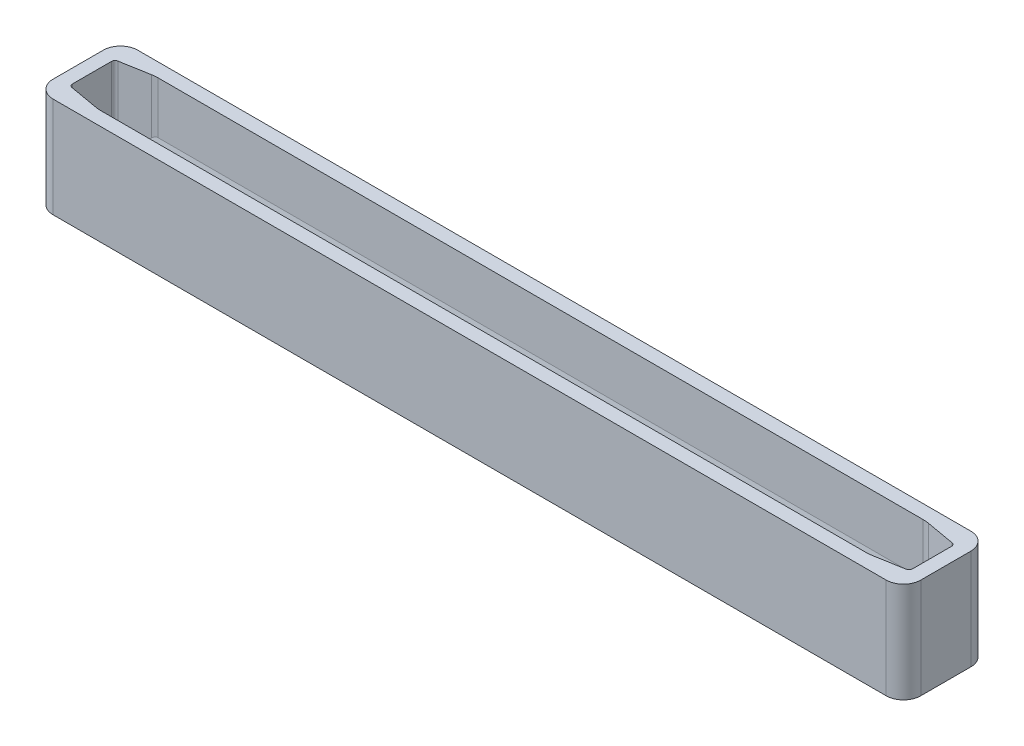
ISO-10303-21;
HEADER;
FILE_DESCRIPTION(('STEP AP214'),'2;1');
FILE_NAME('part.step','',(''),(''),'','','');
FILE_SCHEMA(('AUTOMOTIVE_DESIGN { 1 0 10303 214 1 1 1 1 }'));
ENDSEC;
DATA;
#1=APPLICATION_CONTEXT('core data for automotive mechanical design processes');
#2=APPLICATION_PROTOCOL_DEFINITION('international standard','automotive_design',2000,#1);
#3=PRODUCT_CONTEXT('',#1,'mechanical');
#4=PRODUCT('Part','Part','',(#3));
#5=PRODUCT_RELATED_PRODUCT_CATEGORY('part','',(#4));
#6=PRODUCT_DEFINITION_FORMATION('','',#4);
#7=PRODUCT_DEFINITION_CONTEXT('part definition',#1,'design');
#8=PRODUCT_DEFINITION('design','',#6,#7);
#9=PRODUCT_DEFINITION_SHAPE('','',#8);
#10=(LENGTH_UNIT() NAMED_UNIT(*) SI_UNIT(.MILLI.,.METRE.));
#11=(NAMED_UNIT(*) PLANE_ANGLE_UNIT() SI_UNIT($,.RADIAN.));
#12=(NAMED_UNIT(*) SI_UNIT($,.STERADIAN.) SOLID_ANGLE_UNIT());
#13=UNCERTAINTY_MEASURE_WITH_UNIT(LENGTH_MEASURE(1.E-05),#10,'distance_accuracy_value','');
#14=(GEOMETRIC_REPRESENTATION_CONTEXT(3) GLOBAL_UNCERTAINTY_ASSIGNED_CONTEXT((#13)) GLOBAL_UNIT_ASSIGNED_CONTEXT((#10,
#11,#12)) REPRESENTATION_CONTEXT('',''));
#15=CARTESIAN_POINT('',(0.,0.,0.));
#16=DIRECTION('',(0.,0.,1.));
#17=DIRECTION('',(1.,0.,0.));
#18=AXIS2_PLACEMENT_3D('',#15,#16,#17);
#19=CARTESIAN_POINT('',(0.,25.,0.));
#20=DIRECTION('',(0.,-1.,0.));
#21=DIRECTION('',(0.,0.,-1.));
#22=AXIS2_PLACEMENT_3D('',#19,#20,#21);
#23=PLANE('',#22);
#24=DIRECTION('',(0.,0.,-1.));
#25=VECTOR('',#24,1.);
#26=CARTESIAN_POINT('',(125.5,25.,12.25));
#27=LINE('',#26,#25);
#28=CARTESIAN_POINT('',(125.5,25.,7.25000000000001));
#29=VERTEX_POINT('',#28);
#30=CARTESIAN_POINT('',(125.5,25.,-7.24999999999999));
#31=VERTEX_POINT('',#30);
#32=EDGE_CURVE('E262',#29,#31,#27,.T.);
#33=ORIENTED_EDGE('',*,*,#32,.T.);
#34=CARTESIAN_POINT('',(120.5,25.,-7.24999999999999));
#35=DIRECTION('',(0.,-1.,0.));
#36=DIRECTION('',(0.,0.,-1.));
#37=AXIS2_PLACEMENT_3D('',#34,#35,#36);
#38=CIRCLE('',#37,5.);
#39=CARTESIAN_POINT('',(120.5,25.,-12.25));
#40=VERTEX_POINT('',#39);
#41=EDGE_CURVE('E600',#31,#40,#38,.F.);
#42=ORIENTED_EDGE('',*,*,#41,.T.);
#43=DIRECTION('',(-1.,0.,0.));
#44=VECTOR('',#43,1.);
#45=CARTESIAN_POINT('',(-125.5,25.,-12.25));
#46=LINE('',#45,#44);
#47=CARTESIAN_POINT('',(-120.5,25.,-12.25));
#48=VERTEX_POINT('',#47);
#49=EDGE_CURVE('E265',#40,#48,#46,.T.);
#50=ORIENTED_EDGE('',*,*,#49,.T.);
#51=CARTESIAN_POINT('',(-120.5,25.,-7.24999999999999));
#52=DIRECTION('',(0.,-1.,0.));
#53=DIRECTION('',(0.,0.,-1.));
#54=AXIS2_PLACEMENT_3D('',#51,#52,#53);
#55=CIRCLE('',#54,5.);
#56=CARTESIAN_POINT('',(-125.5,25.,-7.24999999999999));
#57=VERTEX_POINT('',#56);
#58=EDGE_CURVE('E596',#48,#57,#55,.F.);
#59=ORIENTED_EDGE('',*,*,#58,.T.);
#60=DIRECTION('',(0.,0.,1.));
#61=VECTOR('',#60,1.);
#62=CARTESIAN_POINT('',(-125.5,25.,12.25));
#63=LINE('',#62,#61);
#64=CARTESIAN_POINT('',(-125.5,25.,7.25000000000001));
#65=VERTEX_POINT('',#64);
#66=EDGE_CURVE('E251',#57,#65,#63,.T.);
#67=ORIENTED_EDGE('',*,*,#66,.T.);
#68=CARTESIAN_POINT('',(-120.5,25.,7.25000000000001));
#69=DIRECTION('',(0.,-1.,0.));
#70=DIRECTION('',(0.,0.,-1.));
#71=AXIS2_PLACEMENT_3D('',#68,#69,#70);
#72=CIRCLE('',#71,5.);
#73=CARTESIAN_POINT('',(-120.5,25.,12.25));
#74=VERTEX_POINT('',#73);
#75=EDGE_CURVE('E57',#65,#74,#72,.F.);
#76=ORIENTED_EDGE('',*,*,#75,.T.);
#77=DIRECTION('',(1.,0.,0.));
#78=VECTOR('',#77,1.);
#79=CARTESIAN_POINT('',(-125.5,25.,12.25));
#80=LINE('',#79,#78);
#81=CARTESIAN_POINT('',(120.5,25.,12.25));
#82=VERTEX_POINT('',#81);
#83=EDGE_CURVE('E254',#74,#82,#80,.T.);
#84=ORIENTED_EDGE('',*,*,#83,.T.);
#85=CARTESIAN_POINT('',(120.5,25.,7.25000000000001));
#86=DIRECTION('',(0.,-1.,0.));
#87=DIRECTION('',(0.,0.,-1.));
#88=AXIS2_PLACEMENT_3D('',#85,#86,#87);
#89=CIRCLE('',#88,5.);
#90=EDGE_CURVE('E598',#82,#29,#89,.F.);
#91=ORIENTED_EDGE('',*,*,#90,.T.);
#92=EDGE_LOOP('',(#33,#42,#50,#59,#67,#76,#84,#91));
#93=FACE_BOUND('',#92,.T.);
#94=DIRECTION('',(0.,0.,-1.));
#95=VECTOR('',#94,1.);
#96=CARTESIAN_POINT('',(121.5,25.,8.25000000000001));
#97=LINE('',#96,#95);
#98=CARTESIAN_POINT('',(121.5,25.,5.64763056173808));
#99=VERTEX_POINT('',#98);
#100=CARTESIAN_POINT('',(121.5,25.,-5.64763056173805));
#101=VERTEX_POINT('',#100);
#102=EDGE_CURVE('E529',#99,#101,#97,.T.);
#103=ORIENTED_EDGE('',*,*,#102,.F.);
#104=CARTESIAN_POINT('',(120.5,25.,5.64763056173808));
#105=DIRECTION('',(0.,-1.,0.));
#106=DIRECTION('',(0.,0.,-1.));
#107=AXIS2_PLACEMENT_3D('',#104,#105,#106);
#108=CIRCLE('',#107,1.);
#109=CARTESIAN_POINT('',(120.673648177667,25.,6.63243831475027));
#110=VERTEX_POINT('',#109);
#111=EDGE_CURVE('E345',#99,#110,#108,.T.);
#112=ORIENTED_EDGE('',*,*,#111,.T.);
#113=DIRECTION('',(0.984807753012207,0.,-0.173648177666935));
#114=VECTOR('',#113,1.);
#115=CARTESIAN_POINT('',(4.77296948240425,25.,27.0688550511485));
#116=LINE('',#115,#114);
#117=CARTESIAN_POINT('',(112.361595141411,25.,8.09807753012207));
#118=VERTEX_POINT('',#117);
#119=EDGE_CURVE('E278',#110,#118,#116,.F.);
#120=ORIENTED_EDGE('',*,*,#119,.T.);
#121=CARTESIAN_POINT('',(110.625113364741,25.,-1.74999999999999));
#122=DIRECTION('',(0.,-1.,0.));
#123=DIRECTION('',(0.,0.,-1.));
#124=AXIS2_PLACEMENT_3D('',#121,#122,#123);
#125=CIRCLE('',#124,10.);
#126=CARTESIAN_POINT('',(110.625113364741,25.,8.25000000000001));
#127=VERTEX_POINT('',#126);
#128=EDGE_CURVE('E250',#118,#127,#125,.T.);
#129=ORIENTED_EDGE('',*,*,#128,.T.);
#130=DIRECTION('',(1.,0.,0.));
#131=VECTOR('',#130,1.);
#132=CARTESIAN_POINT('',(-121.5,25.,8.25000000000001));
#133=LINE('',#132,#131);
#134=CARTESIAN_POINT('',(-110.625113364741,25.,8.25000000000001));
#135=VERTEX_POINT('',#134);
#136=EDGE_CURVE('E241',#135,#127,#133,.T.);
#137=ORIENTED_EDGE('',*,*,#136,.F.);
#138=CARTESIAN_POINT('',(-110.625113364741,25.,-1.74999999999999));
#139=DIRECTION('',(0.,-1.,0.));
#140=DIRECTION('',(0.,0.,-1.));
#141=AXIS2_PLACEMENT_3D('',#138,#139,#140);
#142=CIRCLE('',#141,10.);
#143=CARTESIAN_POINT('',(-112.36159514141,25.,8.09807753012208));
#144=VERTEX_POINT('',#143);
#145=EDGE_CURVE('E222',#135,#144,#142,.T.);
#146=ORIENTED_EDGE('',*,*,#145,.T.);
#147=DIRECTION('',(0.984807753012207,0.,0.173648177666935));
#148=VECTOR('',#147,1.);
#149=CARTESIAN_POINT('',(-4.77296948240423,25.,27.0688550511484));
#150=LINE('',#149,#148);
#151=CARTESIAN_POINT('',(-120.673648177667,25.,6.63243831475028));
#152=VERTEX_POINT('',#151);
#153=EDGE_CURVE('E280',#144,#152,#150,.F.);
#154=ORIENTED_EDGE('',*,*,#153,.T.);
#155=CARTESIAN_POINT('',(-120.5,25.,5.64763056173808));
#156=DIRECTION('',(0.,-1.,0.));
#157=DIRECTION('',(0.,0.,-1.));
#158=AXIS2_PLACEMENT_3D('',#155,#156,#157);
#159=CIRCLE('',#158,1.);
#160=CARTESIAN_POINT('',(-121.5,25.,5.64763056173808));
#161=VERTEX_POINT('',#160);
#162=EDGE_CURVE('E349',#152,#161,#159,.T.);
#163=ORIENTED_EDGE('',*,*,#162,.T.);
#164=DIRECTION('',(0.,0.,1.));
#165=VECTOR('',#164,1.);
#166=CARTESIAN_POINT('',(-121.5,25.,8.25000000000001));
#167=LINE('',#166,#165);
#168=CARTESIAN_POINT('',(-121.5,25.,-5.64763056173805));
#169=VERTEX_POINT('',#168);
#170=EDGE_CURVE('E252',#169,#161,#167,.T.);
#171=ORIENTED_EDGE('',*,*,#170,.F.);
#172=CARTESIAN_POINT('',(-120.5,25.,-5.64763056173805));
#173=DIRECTION('',(0.,-1.,0.));
#174=DIRECTION('',(0.,0.,-1.));
#175=AXIS2_PLACEMENT_3D('',#172,#173,#174);
#176=CIRCLE('',#175,1.);
#177=CARTESIAN_POINT('',(-120.673648177667,25.,-6.63243831475025));
#178=VERTEX_POINT('',#177);
#179=EDGE_CURVE('E351',#169,#178,#176,.T.);
#180=ORIENTED_EDGE('',*,*,#179,.T.);
#181=DIRECTION('',(-0.984807753012207,0.,0.173648177666935));
#182=VECTOR('',#181,1.);
#183=CARTESIAN_POINT('',(-4.77296948240422,25.,-27.0688550511484));
#184=LINE('',#183,#182);
#185=CARTESIAN_POINT('',(-112.36159514141,25.,-8.09807753012205));
#186=VERTEX_POINT('',#185);
#187=EDGE_CURVE('E282',#178,#186,#184,.F.);
#188=ORIENTED_EDGE('',*,*,#187,.T.);
#189=CARTESIAN_POINT('',(-110.625113364741,25.,1.75000000000001));
#190=DIRECTION('',(0.,-1.,0.));
#191=DIRECTION('',(0.,0.,-1.));
#192=AXIS2_PLACEMENT_3D('',#189,#190,#191);
#193=CIRCLE('',#192,10.);
#194=CARTESIAN_POINT('',(-110.625113364741,25.,-8.24999999999999));
#195=VERTEX_POINT('',#194);
#196=EDGE_CURVE('E234',#186,#195,#193,.T.);
#197=ORIENTED_EDGE('',*,*,#196,.T.);
#198=DIRECTION('',(-1.,0.,0.));
#199=VECTOR('',#198,1.);
#200=CARTESIAN_POINT('',(-121.5,25.,-8.24999999999999));
#201=LINE('',#200,#199);
#202=CARTESIAN_POINT('',(110.625113364741,25.,-8.24999999999999));
#203=VERTEX_POINT('',#202);
#204=EDGE_CURVE('E257',#203,#195,#201,.T.);
#205=ORIENTED_EDGE('',*,*,#204,.F.);
#206=CARTESIAN_POINT('',(110.625113364741,25.,1.75000000000001));
#207=DIRECTION('',(0.,-1.,0.));
#208=DIRECTION('',(0.,0.,-1.));
#209=AXIS2_PLACEMENT_3D('',#206,#207,#208);
#210=CIRCLE('',#209,10.);
#211=CARTESIAN_POINT('',(112.361595141411,25.,-8.09807753012205));
#212=VERTEX_POINT('',#211);
#213=EDGE_CURVE('E323',#203,#212,#210,.T.);
#214=ORIENTED_EDGE('',*,*,#213,.T.);
#215=DIRECTION('',(-0.984807753012207,0.,-0.173648177666935));
#216=VECTOR('',#215,1.);
#217=CARTESIAN_POINT('',(4.77296948240424,25.,-27.0688550511485));
#218=LINE('',#217,#216);
#219=CARTESIAN_POINT('',(120.673648177667,25.,-6.63243831475025));
#220=VERTEX_POINT('',#219);
#221=EDGE_CURVE('E246',#212,#220,#218,.F.);
#222=ORIENTED_EDGE('',*,*,#221,.T.);
#223=CARTESIAN_POINT('',(120.5,25.,-5.64763056173805));
#224=DIRECTION('',(0.,-1.,0.));
#225=DIRECTION('',(0.,0.,-1.));
#226=AXIS2_PLACEMENT_3D('',#223,#224,#225);
#227=CIRCLE('',#226,1.);
#228=EDGE_CURVE('E347',#220,#101,#227,.T.);
#229=ORIENTED_EDGE('',*,*,#228,.T.);
#230=EDGE_LOOP('',(#103,#112,#120,#129,#137,#146,#154,#163,#171,#180,#188,#197,#205,#214,#222,#229));
#231=FACE_BOUND('',#230,.T.);
#232=ADVANCED_FACE('F35',(#93,#231),#23,.F.);
#233=CARTESIAN_POINT('',(-125.5,25.,12.25));
#234=DIRECTION('',(1.,0.,0.));
#235=DIRECTION('',(0.,0.,-1.));
#236=AXIS2_PLACEMENT_3D('',#233,#234,#235);
#237=PLANE('',#236);
#238=ORIENTED_EDGE('',*,*,#66,.F.);
#239=DIRECTION('',(0.,-1.,0.));
#240=VECTOR('',#239,1.);
#241=CARTESIAN_POINT('',(-125.5,25.,-7.24999999999999));
#242=LINE('',#241,#240);
#243=CARTESIAN_POINT('',(-125.5,-4.,-7.24999999999999));
#244=VERTEX_POINT('',#243);
#245=EDGE_CURVE('E11',#57,#244,#242,.T.);
#246=ORIENTED_EDGE('',*,*,#245,.T.);
#247=DIRECTION('',(0.,0.,-1.));
#248=VECTOR('',#247,1.);
#249=CARTESIAN_POINT('',(-125.5,-4.,12.25));
#250=LINE('',#249,#248);
#251=CARTESIAN_POINT('',(-125.5,-4.,7.25000000000001));
#252=VERTEX_POINT('',#251);
#253=EDGE_CURVE('E291',#252,#244,#250,.T.);
#254=ORIENTED_EDGE('',*,*,#253,.F.);
#255=DIRECTION('',(0.,-1.,0.));
#256=VECTOR('',#255,1.);
#257=CARTESIAN_POINT('',(-125.5,25.,7.25000000000001));
#258=LINE('',#257,#256);
#259=EDGE_CURVE('E43',#252,#65,#258,.F.);
#260=ORIENTED_EDGE('',*,*,#259,.T.);
#261=EDGE_LOOP('',(#238,#246,#254,#260));
#262=FACE_BOUND('',#261,.T.);
#263=ADVANCED_FACE('F473',(#262),#237,.F.);
#264=CARTESIAN_POINT('',(-125.5,25.,12.25));
#265=DIRECTION('',(0.,0.,-1.));
#266=DIRECTION('',(-1.,0.,0.));
#267=AXIS2_PLACEMENT_3D('',#264,#265,#266);
#268=PLANE('',#267);
#269=DIRECTION('',(1.,0.,0.));
#270=VECTOR('',#269,1.);
#271=CARTESIAN_POINT('',(-125.5,-4.,12.25));
#272=LINE('',#271,#270);
#273=CARTESIAN_POINT('',(-120.5,-4.,12.25));
#274=VERTEX_POINT('',#273);
#275=CARTESIAN_POINT('',(120.5,-4.,12.25));
#276=VERTEX_POINT('',#275);
#277=EDGE_CURVE('E524',#274,#276,#272,.T.);
#278=ORIENTED_EDGE('',*,*,#277,.T.);
#279=DIRECTION('',(0.,-1.,0.));
#280=VECTOR('',#279,1.);
#281=CARTESIAN_POINT('',(120.5,25.,12.25));
#282=LINE('',#281,#280);
#283=EDGE_CURVE('E50',#276,#82,#282,.F.);
#284=ORIENTED_EDGE('',*,*,#283,.T.);
#285=ORIENTED_EDGE('',*,*,#83,.F.);
#286=DIRECTION('',(0.,-1.,0.));
#287=VECTOR('',#286,1.);
#288=CARTESIAN_POINT('',(-120.5,25.,12.25));
#289=LINE('',#288,#287);
#290=EDGE_CURVE('E602',#74,#274,#289,.T.);
#291=ORIENTED_EDGE('',*,*,#290,.T.);
#292=EDGE_LOOP('',(#278,#284,#285,#291));
#293=FACE_BOUND('',#292,.T.);
#294=ADVANCED_FACE('F476',(#293),#268,.F.);
#295=CARTESIAN_POINT('',(125.5,25.,12.25));
#296=DIRECTION('',(-1.,0.,0.));
#297=DIRECTION('',(0.,0.,1.));
#298=AXIS2_PLACEMENT_3D('',#295,#296,#297);
#299=PLANE('',#298);
#300=DIRECTION('',(0.,0.,-1.));
#301=VECTOR('',#300,1.);
#302=CARTESIAN_POINT('',(125.5,-4.,12.25));
#303=LINE('',#302,#301);
#304=CARTESIAN_POINT('',(125.5,-4.,7.25000000000001));
#305=VERTEX_POINT('',#304);
#306=CARTESIAN_POINT('',(125.5,-4.,-7.24999999999999));
#307=VERTEX_POINT('',#306);
#308=EDGE_CURVE('E522',#305,#307,#303,.T.);
#309=ORIENTED_EDGE('',*,*,#308,.T.);
#310=DIRECTION('',(0.,-1.,0.));
#311=VECTOR('',#310,1.);
#312=CARTESIAN_POINT('',(125.5,25.,-7.24999999999999));
#313=LINE('',#312,#311);
#314=EDGE_CURVE('E593',#307,#31,#313,.F.);
#315=ORIENTED_EDGE('',*,*,#314,.T.);
#316=ORIENTED_EDGE('',*,*,#32,.F.);
#317=DIRECTION('',(0.,-1.,0.));
#318=VECTOR('',#317,1.);
#319=CARTESIAN_POINT('',(125.5,25.,7.25000000000001));
#320=LINE('',#319,#318);
#321=EDGE_CURVE('E590',#29,#305,#320,.T.);
#322=ORIENTED_EDGE('',*,*,#321,.T.);
#323=EDGE_LOOP('',(#309,#315,#316,#322));
#324=FACE_BOUND('',#323,.T.);
#325=ADVANCED_FACE('F480',(#324),#299,.F.);
#326=CARTESIAN_POINT('',(-125.5,25.,-12.25));
#327=DIRECTION('',(0.,0.,1.));
#328=DIRECTION('',(1.,0.,0.));
#329=AXIS2_PLACEMENT_3D('',#326,#327,#328);
#330=PLANE('',#329);
#331=ORIENTED_EDGE('',*,*,#49,.F.);
#332=DIRECTION('',(0.,-1.,0.));
#333=VECTOR('',#332,1.);
#334=CARTESIAN_POINT('',(120.5,25.,-12.25));
#335=LINE('',#334,#333);
#336=CARTESIAN_POINT('',(120.5,-4.,-12.25));
#337=VERTEX_POINT('',#336);
#338=EDGE_CURVE('E580',#40,#337,#335,.T.);
#339=ORIENTED_EDGE('',*,*,#338,.T.);
#340=DIRECTION('',(1.,0.,0.));
#341=VECTOR('',#340,1.);
#342=CARTESIAN_POINT('',(-125.5,-4.,-12.25));
#343=LINE('',#342,#341);
#344=CARTESIAN_POINT('',(-120.5,-4.,-12.25));
#345=VERTEX_POINT('',#344);
#346=EDGE_CURVE('E514',#345,#337,#343,.T.);
#347=ORIENTED_EDGE('',*,*,#346,.F.);
#348=DIRECTION('',(0.,-1.,0.));
#349=VECTOR('',#348,1.);
#350=CARTESIAN_POINT('',(-120.5,25.,-12.25));
#351=LINE('',#350,#349);
#352=EDGE_CURVE('E579',#345,#48,#351,.F.);
#353=ORIENTED_EDGE('',*,*,#352,.T.);
#354=EDGE_LOOP('',(#331,#339,#347,#353));
#355=FACE_BOUND('',#354,.T.);
#356=ADVANCED_FACE('F483',(#355),#330,.F.);
#357=CARTESIAN_POINT('',(121.5,25.,8.25000000000001));
#358=DIRECTION('',(-1.,0.,0.));
#359=DIRECTION('',(0.,0.,1.));
#360=AXIS2_PLACEMENT_3D('',#357,#358,#359);
#361=PLANE('',#360);
#362=DIRECTION('',(0.,1.,0.));
#363=VECTOR('',#362,1.);
#364=CARTESIAN_POINT('',(121.5,25.,-5.64763056173805));
#365=LINE('',#364,#363);
#366=CARTESIAN_POINT('',(121.5,10.,-5.64763056173805));
#367=VERTEX_POINT('',#366);
#368=EDGE_CURVE('E233',#101,#367,#365,.F.);
#369=ORIENTED_EDGE('',*,*,#368,.T.);
#370=DIRECTION('',(0.,0.,-1.));
#371=VECTOR('',#370,1.);
#372=CARTESIAN_POINT('',(121.5,10.,8.25000000000001));
#373=LINE('',#372,#371);
#374=CARTESIAN_POINT('',(121.5,10.,5.64763056173808));
#375=VERTEX_POINT('',#374);
#376=EDGE_CURVE('E411',#367,#375,#373,.F.);
#377=ORIENTED_EDGE('',*,*,#376,.T.);
#378=DIRECTION('',(0.,-1.,0.));
#379=VECTOR('',#378,1.);
#380=CARTESIAN_POINT('',(121.5,25.,5.64763056173808));
#381=LINE('',#380,#379);
#382=EDGE_CURVE('E328',#375,#99,#381,.F.);
#383=ORIENTED_EDGE('',*,*,#382,.T.);
#384=ORIENTED_EDGE('',*,*,#102,.T.);
#385=EDGE_LOOP('',(#369,#377,#383,#384));
#386=FACE_BOUND('',#385,.T.);
#387=ADVANCED_FACE('F487',(#386),#361,.T.);
#388=CARTESIAN_POINT('',(-121.5,25.,-8.24999999999999));
#389=DIRECTION('',(0.,0.,1.));
#390=DIRECTION('',(1.,0.,0.));
#391=AXIS2_PLACEMENT_3D('',#388,#389,#390);
#392=PLANE('',#391);
#393=DIRECTION('',(1.,0.,0.));
#394=VECTOR('',#393,1.);
#395=CARTESIAN_POINT('',(-121.5,9.99999999999976,-8.24999999999999));
#396=LINE('',#395,#394);
#397=CARTESIAN_POINT('',(-110.625113364741,9.99999999999976,-8.24999999999999));
#398=VERTEX_POINT('',#397);
#399=CARTESIAN_POINT('',(110.625113364741,9.99999999999976,-8.24999999999999));
#400=VERTEX_POINT('',#399);
#401=EDGE_CURVE('E275',#398,#400,#396,.T.);
#402=ORIENTED_EDGE('',*,*,#401,.T.);
#403=DIRECTION('',(0.,-1.,0.));
#404=VECTOR('',#403,1.);
#405=CARTESIAN_POINT('',(110.625113364741,25.,-8.24999999999999));
#406=LINE('',#405,#404);
#407=EDGE_CURVE('E307',#400,#203,#406,.F.);
#408=ORIENTED_EDGE('',*,*,#407,.T.);
#409=ORIENTED_EDGE('',*,*,#204,.T.);
#410=DIRECTION('',(0.,1.,0.));
#411=VECTOR('',#410,1.);
#412=CARTESIAN_POINT('',(-110.625113364741,25.,-8.24999999999999));
#413=LINE('',#412,#411);
#414=EDGE_CURVE('E304',#195,#398,#413,.F.);
#415=ORIENTED_EDGE('',*,*,#414,.T.);
#416=EDGE_LOOP('',(#402,#408,#409,#415));
#417=FACE_BOUND('',#416,.T.);
#418=ADVANCED_FACE('F493',(#417),#392,.T.);
#419=CARTESIAN_POINT('',(-121.5,25.,8.25000000000001));
#420=DIRECTION('',(1.,0.,0.));
#421=DIRECTION('',(0.,0.,-1.));
#422=AXIS2_PLACEMENT_3D('',#419,#420,#421);
#423=PLANE('',#422);
#424=DIRECTION('',(0.,1.,0.));
#425=VECTOR('',#424,1.);
#426=CARTESIAN_POINT('',(-121.5,25.,5.64763056173808));
#427=LINE('',#426,#425);
#428=CARTESIAN_POINT('',(-121.5,10.,5.64763056173808));
#429=VERTEX_POINT('',#428);
#430=EDGE_CURVE('E337',#161,#429,#427,.F.);
#431=ORIENTED_EDGE('',*,*,#430,.T.);
#432=DIRECTION('',(0.,0.,1.));
#433=VECTOR('',#432,1.);
#434=CARTESIAN_POINT('',(-121.5,10.,8.25000000000001));
#435=LINE('',#434,#433);
#436=CARTESIAN_POINT('',(-121.5,10.,-5.64763056173805));
#437=VERTEX_POINT('',#436);
#438=EDGE_CURVE('E373',#429,#437,#435,.F.);
#439=ORIENTED_EDGE('',*,*,#438,.T.);
#440=DIRECTION('',(0.,-1.,0.));
#441=VECTOR('',#440,1.);
#442=CARTESIAN_POINT('',(-121.5,25.,-5.64763056173805));
#443=LINE('',#442,#441);
#444=EDGE_CURVE('E335',#437,#169,#443,.F.);
#445=ORIENTED_EDGE('',*,*,#444,.T.);
#446=ORIENTED_EDGE('',*,*,#170,.T.);
#447=EDGE_LOOP('',(#431,#439,#445,#446));
#448=FACE_BOUND('',#447,.T.);
#449=ADVANCED_FACE('F497',(#448),#423,.T.);
#450=CARTESIAN_POINT('',(-121.5,25.,8.25000000000001));
#451=DIRECTION('',(0.,0.,-1.));
#452=DIRECTION('',(-1.,0.,0.));
#453=AXIS2_PLACEMENT_3D('',#450,#451,#452);
#454=PLANE('',#453);
#455=ORIENTED_EDGE('',*,*,#136,.T.);
#456=DIRECTION('',(0.,1.,0.));
#457=VECTOR('',#456,1.);
#458=CARTESIAN_POINT('',(110.625113364741,25.,8.25000000000001));
#459=LINE('',#458,#457);
#460=CARTESIAN_POINT('',(110.625113364741,9.99999999999976,8.25000000000001));
#461=VERTEX_POINT('',#460);
#462=EDGE_CURVE('E245',#127,#461,#459,.F.);
#463=ORIENTED_EDGE('',*,*,#462,.T.);
#464=DIRECTION('',(-1.,0.,0.));
#465=VECTOR('',#464,1.);
#466=CARTESIAN_POINT('',(-121.5,9.99999999999976,8.25000000000001));
#467=LINE('',#466,#465);
#468=CARTESIAN_POINT('',(-110.625113364741,9.99999999999976,8.25000000000001));
#469=VERTEX_POINT('',#468);
#470=EDGE_CURVE('E244',#461,#469,#467,.T.);
#471=ORIENTED_EDGE('',*,*,#470,.T.);
#472=DIRECTION('',(0.,-1.,0.));
#473=VECTOR('',#472,1.);
#474=CARTESIAN_POINT('',(-110.625113364741,25.,8.25000000000001));
#475=LINE('',#474,#473);
#476=EDGE_CURVE('E226',#469,#135,#475,.F.);
#477=ORIENTED_EDGE('',*,*,#476,.T.);
#478=EDGE_LOOP('',(#455,#463,#471,#477));
#479=FACE_BOUND('',#478,.T.);
#480=ADVANCED_FACE('F239',(#479),#454,.T.);
#481=CARTESIAN_POINT('',(0.,0.,0.));
#482=DIRECTION('',(0.,-1.,0.));
#483=DIRECTION('',(0.,0.,-1.));
#484=AXIS2_PLACEMENT_3D('',#481,#482,#483);
#485=PLANE('',#484);
#486=DIRECTION('',(-1.,0.,0.));
#487=VECTOR('',#486,1.);
#488=CARTESIAN_POINT('',(0.,0.,-6.48673019291533));
#489=LINE('',#488,#487);
#490=CARTESIAN_POINT('',(111.5,0.,-6.48673019291533));
#491=VERTEX_POINT('',#490);
#492=CARTESIAN_POINT('',(-111.5,0.,-6.48673019291533));
#493=VERTEX_POINT('',#492);
#494=EDGE_CURVE('E269',#491,#493,#489,.T.);
#495=ORIENTED_EDGE('',*,*,#494,.T.);
#496=DIRECTION('',(0.,0.,1.));
#497=VECTOR('',#496,1.);
#498=CARTESIAN_POINT('',(-111.5,0.,0.));
#499=LINE('',#498,#497);
#500=CARTESIAN_POINT('',(-111.5,0.,6.48673019291535));
#501=VERTEX_POINT('',#500);
#502=EDGE_CURVE('E356',#493,#501,#499,.T.);
#503=ORIENTED_EDGE('',*,*,#502,.T.);
#504=DIRECTION('',(1.,0.,0.));
#505=VECTOR('',#504,1.);
#506=CARTESIAN_POINT('',(0.,0.,6.48673019291535));
#507=LINE('',#506,#505);
#508=CARTESIAN_POINT('',(111.5,0.,6.48673019291535));
#509=VERTEX_POINT('',#508);
#510=EDGE_CURVE('E272',#501,#509,#507,.T.);
#511=ORIENTED_EDGE('',*,*,#510,.T.);
#512=DIRECTION('',(0.,0.,-1.));
#513=VECTOR('',#512,1.);
#514=CARTESIAN_POINT('',(111.5,0.,0.));
#515=LINE('',#514,#513);
#516=EDGE_CURVE('E353',#509,#491,#515,.T.);
#517=ORIENTED_EDGE('',*,*,#516,.T.);
#518=EDGE_LOOP('',(#495,#503,#511,#517));
#519=FACE_BOUND('',#518,.T.);
#520=ADVANCED_FACE('F504',(#519),#485,.F.);
#521=CARTESIAN_POINT('',(0.,-4.,0.));
#522=DIRECTION('',(0.,-1.,0.));
#523=DIRECTION('',(0.,0.,-1.));
#524=AXIS2_PLACEMENT_3D('',#521,#522,#523);
#525=PLANE('',#524);
#526=ORIENTED_EDGE('',*,*,#346,.T.);
#527=CARTESIAN_POINT('',(120.5,-4.,-7.24999999999999));
#528=DIRECTION('',(0.,-1.,0.));
#529=DIRECTION('',(0.,0.,-1.));
#530=AXIS2_PLACEMENT_3D('',#527,#528,#529);
#531=CIRCLE('',#530,5.);
#532=EDGE_CURVE('E516',#337,#307,#531,.T.);
#533=ORIENTED_EDGE('',*,*,#532,.T.);
#534=ORIENTED_EDGE('',*,*,#308,.F.);
#535=CARTESIAN_POINT('',(120.5,-4.,7.25000000000001));
#536=DIRECTION('',(0.,-1.,0.));
#537=DIRECTION('',(0.,0.,-1.));
#538=AXIS2_PLACEMENT_3D('',#535,#536,#537);
#539=CIRCLE('',#538,5.);
#540=EDGE_CURVE('E587',#305,#276,#539,.T.);
#541=ORIENTED_EDGE('',*,*,#540,.T.);
#542=ORIENTED_EDGE('',*,*,#277,.F.);
#543=CARTESIAN_POINT('',(-120.5,-4.,7.25000000000001));
#544=DIRECTION('',(0.,-1.,0.));
#545=DIRECTION('',(0.,0.,-1.));
#546=AXIS2_PLACEMENT_3D('',#543,#544,#545);
#547=CIRCLE('',#546,5.);
#548=EDGE_CURVE('E582',#274,#252,#547,.T.);
#549=ORIENTED_EDGE('',*,*,#548,.T.);
#550=ORIENTED_EDGE('',*,*,#253,.T.);
#551=CARTESIAN_POINT('',(-120.5,-4.,-7.24999999999999));
#552=DIRECTION('',(0.,-1.,0.));
#553=DIRECTION('',(0.,0.,-1.));
#554=AXIS2_PLACEMENT_3D('',#551,#552,#553);
#555=CIRCLE('',#554,5.);
#556=EDGE_CURVE('E519',#244,#345,#555,.T.);
#557=ORIENTED_EDGE('',*,*,#556,.T.);
#558=EDGE_LOOP('',(#526,#533,#534,#541,#542,#549,#550,#557));
#559=FACE_BOUND('',#558,.T.);
#560=ADVANCED_FACE('F465',(#559),#525,.T.);
#561=CARTESIAN_POINT('',(-121.5,25.,6.48673019291535));
#562=DIRECTION('',(0.173648177666935,0.,-0.984807753012207));
#563=DIRECTION('',(0.,1.,0.));
#564=AXIS2_PLACEMENT_3D('',#561,#562,#563);
#565=PLANE('',#564);
#566=DIRECTION('',(0.701673843159863,0.701673843159863,0.123724030206487));
#567=VECTOR('',#566,1.);
#568=CARTESIAN_POINT('',(-61.6799388657699,59.8200611342298,17.0346209585102));
#569=LINE('',#568,#567);
#570=CARTESIAN_POINT('',(-118.571067811865,2.92893218813451,7.00317996234897));
#571=VERTEX_POINT('',#570);
#572=CARTESIAN_POINT('',(-112.36159514141,9.13840485858967,8.09807753012209));
#573=VERTEX_POINT('',#572);
#574=EDGE_CURVE('E288',#571,#573,#569,.T.);
#575=ORIENTED_EDGE('',*,*,#574,.F.);
#576=CARTESIAN_POINT('',(-111.5,10.,8.25000000000006));
#577=DIRECTION('',(0.173648177666935,0.,-0.984807753012207));
#578=DIRECTION('',(0.984807753012207,0.,0.173648177666935));
#579=AXIS2_PLACEMENT_3D('',#576,#577,#578);
#580=ELLIPSE('',#579,10.1542661188575,10.);
#581=CARTESIAN_POINT('',(-120.673648177667,6.01952526545033,6.63243831475029));
#582=VERTEX_POINT('',#581);
#583=EDGE_CURVE('E363',#571,#582,#580,.T.);
#584=ORIENTED_EDGE('',*,*,#583,.T.);
#585=DIRECTION('',(0.,-1.,0.));
#586=VECTOR('',#585,1.);
#587=CARTESIAN_POINT('',(-120.673648177667,25.,6.63243831475029));
#588=LINE('',#587,#586);
#589=EDGE_CURVE('E340',#582,#152,#588,.F.);
#590=ORIENTED_EDGE('',*,*,#589,.T.);
#591=ORIENTED_EDGE('',*,*,#153,.F.);
#592=DIRECTION('',(0.,1.,0.));
#593=VECTOR('',#592,1.);
#594=CARTESIAN_POINT('',(-112.36159514141,25.,8.09807753012209));
#595=LINE('',#594,#593);
#596=EDGE_CURVE('E228',#144,#573,#595,.F.);
#597=ORIENTED_EDGE('',*,*,#596,.T.);
#598=EDGE_LOOP('',(#575,#584,#590,#591,#597));
#599=FACE_BOUND('',#598,.T.);
#600=ADVANCED_FACE('F461',(#599),#565,.T.);
#601=CARTESIAN_POINT('',(0.,0.,6.48673019291535));
#602=DIRECTION('',(0.,-0.173648177666935,0.984807753012207));
#603=DIRECTION('',(1.,0.,0.));
#604=AXIS2_PLACEMENT_3D('',#601,#602,#603);
#605=PLANE('',#604);
#606=ORIENTED_EDGE('',*,*,#510,.F.);
#607=CARTESIAN_POINT('',(-111.5,10.,8.25000000000006));
#608=DIRECTION('',(0.,-0.173648177666935,0.984807753012207));
#609=DIRECTION('',(0.,0.984807753012207,0.173648177666935));
#610=AXIS2_PLACEMENT_3D('',#607,#608,#609);
#611=ELLIPSE('',#610,10.1542661188575,10.);
#612=EDGE_CURVE('E361',#501,#571,#611,.F.);
#613=ORIENTED_EDGE('',*,*,#612,.T.);
#614=ORIENTED_EDGE('',*,*,#574,.T.);
#615=CARTESIAN_POINT('',(-110.625113364741,-46.7128181961756,-1.74999999999999));
#616=DIRECTION('',(0.,-0.173648177666935,0.984807753012207));
#617=DIRECTION('',(0.,-0.984807753012207,-0.173648177666935));
#618=AXIS2_PLACEMENT_3D('',#615,#616,#617);
#619=ELLIPSE('',#618,57.5877048314346,10.);
#620=EDGE_CURVE('E296',#573,#469,#619,.F.);
#621=ORIENTED_EDGE('',*,*,#620,.T.);
#622=ORIENTED_EDGE('',*,*,#470,.F.);
#623=CARTESIAN_POINT('',(110.625113364741,-46.7128181961756,-1.74999999999999));
#624=DIRECTION('',(0.,-0.173648177666935,0.984807753012207));
#625=DIRECTION('',(0.,0.984807753012207,0.173648177666935));
#626=AXIS2_PLACEMENT_3D('',#623,#624,#625);
#627=ELLIPSE('',#626,57.5877048314346,10.);
#628=CARTESIAN_POINT('',(112.361595141411,9.13840485858966,8.09807753012208));
#629=VERTEX_POINT('',#628);
#630=EDGE_CURVE('E298',#461,#629,#627,.F.);
#631=ORIENTED_EDGE('',*,*,#630,.T.);
#632=DIRECTION('',(-0.701673843159863,0.701673843159863,0.123724030206487));
#633=VECTOR('',#632,1.);
#634=CARTESIAN_POINT('',(104.114807267379,17.3851927326209,9.55220873649323));
#635=LINE('',#634,#633);
#636=CARTESIAN_POINT('',(118.571067811866,2.92893218813452,7.00317996234897));
#637=VERTEX_POINT('',#636);
#638=EDGE_CURVE('E286',#637,#629,#635,.T.);
#639=ORIENTED_EDGE('',*,*,#638,.F.);
#640=CARTESIAN_POINT('',(111.5,10.,8.25000000000006));
#641=DIRECTION('',(0.,-0.173648177666935,0.984807753012207));
#642=DIRECTION('',(0.,-0.984807753012207,-0.173648177666935));
#643=AXIS2_PLACEMENT_3D('',#640,#641,#642);
#644=ELLIPSE('',#643,10.1542661188575,10.);
#645=EDGE_CURVE('E359',#637,#509,#644,.F.);
#646=ORIENTED_EDGE('',*,*,#645,.T.);
#647=EDGE_LOOP('',(#606,#613,#614,#621,#622,#631,#639,#646));
#648=FACE_BOUND('',#647,.T.);
#649=ADVANCED_FACE('F464',(#648),#605,.F.);
#650=CARTESIAN_POINT('',(111.500000000001,25.,8.25000000000001));
#651=DIRECTION('',(-0.173648177666935,0.,-0.984807753012207));
#652=DIRECTION('',(0.,1.,0.));
#653=AXIS2_PLACEMENT_3D('',#650,#651,#652);
#654=PLANE('',#653);
#655=DIRECTION('',(0.,1.,0.));
#656=VECTOR('',#655,1.);
#657=CARTESIAN_POINT('',(120.673648177667,25.,6.63243831475029));
#658=LINE('',#657,#656);
#659=CARTESIAN_POINT('',(120.673648177667,6.01952526545035,6.63243831475029));
#660=VERTEX_POINT('',#659);
#661=EDGE_CURVE('E330',#110,#660,#658,.F.);
#662=ORIENTED_EDGE('',*,*,#661,.T.);
#663=CARTESIAN_POINT('',(111.5,10.,8.25000000000006));
#664=DIRECTION('',(-0.173648177666935,0.,-0.984807753012207));
#665=DIRECTION('',(0.984807753012207,0.,-0.173648177666935));
#666=AXIS2_PLACEMENT_3D('',#663,#664,#665);
#667=ELLIPSE('',#666,10.1542661188575,10.);
#668=EDGE_CURVE('E427',#660,#637,#667,.T.);
#669=ORIENTED_EDGE('',*,*,#668,.T.);
#670=ORIENTED_EDGE('',*,*,#638,.T.);
#671=DIRECTION('',(0.,-1.,0.));
#672=VECTOR('',#671,1.);
#673=CARTESIAN_POINT('',(112.361595141411,25.,8.09807753012208));
#674=LINE('',#673,#672);
#675=EDGE_CURVE('E301',#629,#118,#674,.F.);
#676=ORIENTED_EDGE('',*,*,#675,.T.);
#677=ORIENTED_EDGE('',*,*,#119,.F.);
#678=EDGE_LOOP('',(#662,#669,#670,#676,#677));
#679=FACE_BOUND('',#678,.T.);
#680=ADVANCED_FACE('F453',(#679),#654,.T.);
#681=CARTESIAN_POINT('',(121.5,25.,-6.48673019291533));
#682=DIRECTION('',(-0.173648177666935,0.,0.984807753012207));
#683=DIRECTION('',(0.,1.,0.));
#684=AXIS2_PLACEMENT_3D('',#681,#682,#683);
#685=PLANE('',#684);
#686=DIRECTION('',(-0.701673843159863,0.701673843159863,-0.123724030206487));
#687=VECTOR('',#686,1.);
#688=CARTESIAN_POINT('',(61.6799388657702,59.8200611342301,-17.0346209585102));
#689=LINE('',#688,#687);
#690=CARTESIAN_POINT('',(118.571067811866,2.92893218813453,-7.00317996234894));
#691=VERTEX_POINT('',#690);
#692=CARTESIAN_POINT('',(112.361595141411,9.13840485858967,-8.09807753012206));
#693=VERTEX_POINT('',#692);
#694=EDGE_CURVE('E289',#691,#693,#689,.T.);
#695=ORIENTED_EDGE('',*,*,#694,.F.);
#696=CARTESIAN_POINT('',(111.5,10.,-8.25000000000003));
#697=DIRECTION('',(-0.173648177666935,0.,0.984807753012207));
#698=DIRECTION('',(-0.984807753012207,0.,-0.173648177666935));
#699=AXIS2_PLACEMENT_3D('',#696,#697,#698);
#700=ELLIPSE('',#699,10.1542661188575,10.);
#701=CARTESIAN_POINT('',(120.673648177667,6.01952526545033,-6.63243831475026));
#702=VERTEX_POINT('',#701);
#703=EDGE_CURVE('E403',#691,#702,#700,.T.);
#704=ORIENTED_EDGE('',*,*,#703,.T.);
#705=DIRECTION('',(0.,-1.,0.));
#706=VECTOR('',#705,1.);
#707=CARTESIAN_POINT('',(120.673648177667,25.,-6.63243831475026));
#708=LINE('',#707,#706);
#709=EDGE_CURVE('E333',#702,#220,#708,.F.);
#710=ORIENTED_EDGE('',*,*,#709,.T.);
#711=ORIENTED_EDGE('',*,*,#221,.F.);
#712=DIRECTION('',(0.,1.,0.));
#713=VECTOR('',#712,1.);
#714=CARTESIAN_POINT('',(112.361595141411,25.,-8.09807753012206));
#715=LINE('',#714,#713);
#716=EDGE_CURVE('E310',#212,#693,#715,.F.);
#717=ORIENTED_EDGE('',*,*,#716,.T.);
#718=EDGE_LOOP('',(#695,#704,#710,#711,#717));
#719=FACE_BOUND('',#718,.T.);
#720=ADVANCED_FACE('F449',(#719),#685,.T.);
#721=CARTESIAN_POINT('',(0.,0.,-6.48673019291533));
#722=DIRECTION('',(0.,-0.173648177666935,-0.984807753012207));
#723=DIRECTION('',(-1.,0.,0.));
#724=AXIS2_PLACEMENT_3D('',#721,#722,#723);
#725=PLANE('',#724);
#726=DIRECTION('',(0.701673843159863,0.701673843159863,-0.123724030206487));
#727=VECTOR('',#726,1.);
#728=CARTESIAN_POINT('',(-104.114807267379,17.3851927326209,-9.5522087364932));
#729=LINE('',#728,#727);
#730=CARTESIAN_POINT('',(-118.571067811865,2.92893218813452,-7.00317996234894));
#731=VERTEX_POINT('',#730);
#732=CARTESIAN_POINT('',(-112.36159514141,9.13840485858967,-8.09807753012206));
#733=VERTEX_POINT('',#732);
#734=EDGE_CURVE('E292',#731,#733,#729,.T.);
#735=ORIENTED_EDGE('',*,*,#734,.F.);
#736=CARTESIAN_POINT('',(-111.5,10.,-8.25000000000003));
#737=DIRECTION('',(0.,-0.173648177666935,-0.984807753012207));
#738=DIRECTION('',(0.,-0.984807753012207,0.173648177666935));
#739=AXIS2_PLACEMENT_3D('',#736,#737,#738);
#740=ELLIPSE('',#739,10.1542661188575,10.);
#741=EDGE_CURVE('E401',#731,#493,#740,.F.);
#742=ORIENTED_EDGE('',*,*,#741,.T.);
#743=ORIENTED_EDGE('',*,*,#494,.F.);
#744=CARTESIAN_POINT('',(111.5,10.,-8.25000000000003));
#745=DIRECTION('',(0.,-0.173648177666935,-0.984807753012207));
#746=DIRECTION('',(0.,0.984807753012207,-0.173648177666935));
#747=AXIS2_PLACEMENT_3D('',#744,#745,#746);
#748=ELLIPSE('',#747,10.1542661188575,10.);
#749=EDGE_CURVE('E399',#491,#691,#748,.F.);
#750=ORIENTED_EDGE('',*,*,#749,.T.);
#751=ORIENTED_EDGE('',*,*,#694,.T.);
#752=CARTESIAN_POINT('',(110.625113364741,-46.7128181961756,1.75000000000001));
#753=DIRECTION('',(0.,-0.173648177666935,-0.984807753012207));
#754=DIRECTION('',(0.,-0.984807753012207,0.173648177666935));
#755=AXIS2_PLACEMENT_3D('',#752,#753,#754);
#756=ELLIPSE('',#755,57.5877048314346,10.);
#757=EDGE_CURVE('E316',#693,#400,#756,.F.);
#758=ORIENTED_EDGE('',*,*,#757,.T.);
#759=ORIENTED_EDGE('',*,*,#401,.F.);
#760=CARTESIAN_POINT('',(-110.625113364741,-46.7128181961756,1.75000000000001));
#761=DIRECTION('',(0.,-0.173648177666935,-0.984807753012207));
#762=DIRECTION('',(0.,0.984807753012207,-0.173648177666935));
#763=AXIS2_PLACEMENT_3D('',#760,#761,#762);
#764=ELLIPSE('',#763,57.5877048314346,10.);
#765=EDGE_CURVE('E313',#398,#733,#764,.F.);
#766=ORIENTED_EDGE('',*,*,#765,.T.);
#767=EDGE_LOOP('',(#735,#742,#743,#750,#751,#758,#759,#766));
#768=FACE_BOUND('',#767,.T.);
#769=ADVANCED_FACE('F452',(#768),#725,.F.);
#770=CARTESIAN_POINT('',(-111.5,25.,-8.24999999999999));
#771=DIRECTION('',(0.173648177666935,0.,0.984807753012207));
#772=DIRECTION('',(0.,1.,0.));
#773=AXIS2_PLACEMENT_3D('',#770,#771,#772);
#774=PLANE('',#773);
#775=DIRECTION('',(0.,1.,0.));
#776=VECTOR('',#775,1.);
#777=CARTESIAN_POINT('',(-120.673648177667,25.,-6.63243831475026));
#778=LINE('',#777,#776);
#779=CARTESIAN_POINT('',(-120.673648177667,6.01952526545035,-6.63243831475026));
#780=VERTEX_POINT('',#779);
#781=EDGE_CURVE('E342',#178,#780,#778,.F.);
#782=ORIENTED_EDGE('',*,*,#781,.T.);
#783=CARTESIAN_POINT('',(-111.5,10.,-8.25000000000003));
#784=DIRECTION('',(0.173648177666935,0.,0.984807753012207));
#785=DIRECTION('',(-0.984807753012207,0.,0.173648177666935));
#786=AXIS2_PLACEMENT_3D('',#783,#784,#785);
#787=ELLIPSE('',#786,10.1542661188575,10.);
#788=EDGE_CURVE('E397',#780,#731,#787,.T.);
#789=ORIENTED_EDGE('',*,*,#788,.T.);
#790=ORIENTED_EDGE('',*,*,#734,.T.);
#791=DIRECTION('',(0.,-1.,0.));
#792=VECTOR('',#791,1.);
#793=CARTESIAN_POINT('',(-112.36159514141,25.,-8.09807753012206));
#794=LINE('',#793,#792);
#795=EDGE_CURVE('E318',#733,#186,#794,.F.);
#796=ORIENTED_EDGE('',*,*,#795,.T.);
#797=ORIENTED_EDGE('',*,*,#187,.F.);
#798=EDGE_LOOP('',(#782,#789,#790,#796,#797));
#799=FACE_BOUND('',#798,.T.);
#800=ADVANCED_FACE('F447',(#799),#774,.T.);
#801=CARTESIAN_POINT('',(110.625113364741,25.,-1.74999999999999));
#802=DIRECTION('',(0.,1.,0.));
#803=DIRECTION('',(0.,0.,1.));
#804=AXIS2_PLACEMENT_3D('',#801,#802,#803);
#805=CYLINDRICAL_SURFACE('',#804,10.);
#806=ORIENTED_EDGE('',*,*,#128,.F.);
#807=ORIENTED_EDGE('',*,*,#675,.F.);
#808=ORIENTED_EDGE('',*,*,#630,.F.);
#809=ORIENTED_EDGE('',*,*,#462,.F.);
#810=EDGE_LOOP('',(#806,#807,#808,#809));
#811=FACE_BOUND('',#810,.T.);
#812=ADVANCED_FACE('F443',(#811),#805,.F.);
#813=CARTESIAN_POINT('',(110.625113364741,25.,1.75000000000001));
#814=DIRECTION('',(0.,-1.,0.));
#815=DIRECTION('',(0.,0.,-1.));
#816=AXIS2_PLACEMENT_3D('',#813,#814,#815);
#817=CYLINDRICAL_SURFACE('',#816,10.);
#818=ORIENTED_EDGE('',*,*,#757,.F.);
#819=ORIENTED_EDGE('',*,*,#716,.F.);
#820=ORIENTED_EDGE('',*,*,#213,.F.);
#821=ORIENTED_EDGE('',*,*,#407,.F.);
#822=EDGE_LOOP('',(#818,#819,#820,#821));
#823=FACE_BOUND('',#822,.T.);
#824=ADVANCED_FACE('F439',(#823),#817,.F.);
#825=CARTESIAN_POINT('',(-110.625113364741,25.,1.75000000000001));
#826=DIRECTION('',(0.,1.,0.));
#827=DIRECTION('',(0.,0.,1.));
#828=AXIS2_PLACEMENT_3D('',#825,#826,#827);
#829=CYLINDRICAL_SURFACE('',#828,10.);
#830=ORIENTED_EDGE('',*,*,#196,.F.);
#831=ORIENTED_EDGE('',*,*,#795,.F.);
#832=ORIENTED_EDGE('',*,*,#765,.F.);
#833=ORIENTED_EDGE('',*,*,#414,.F.);
#834=EDGE_LOOP('',(#830,#831,#832,#833));
#835=FACE_BOUND('',#834,.T.);
#836=ADVANCED_FACE('F436',(#835),#829,.F.);
#837=CARTESIAN_POINT('',(-110.625113364741,25.,-1.74999999999999));
#838=DIRECTION('',(0.,-1.,0.));
#839=DIRECTION('',(0.,0.,-1.));
#840=AXIS2_PLACEMENT_3D('',#837,#838,#839);
#841=CYLINDRICAL_SURFACE('',#840,10.);
#842=ORIENTED_EDGE('',*,*,#620,.F.);
#843=ORIENTED_EDGE('',*,*,#596,.F.);
#844=ORIENTED_EDGE('',*,*,#145,.F.);
#845=ORIENTED_EDGE('',*,*,#476,.F.);
#846=EDGE_LOOP('',(#842,#843,#844,#845));
#847=FACE_BOUND('',#846,.T.);
#848=ADVANCED_FACE('F225',(#847),#841,.F.);
#849=CARTESIAN_POINT('',(120.5,25.,5.64763056173808));
#850=DIRECTION('',(0.,-1.,0.));
#851=DIRECTION('',(0.,0.,-1.));
#852=AXIS2_PLACEMENT_3D('',#849,#850,#851);
#853=CYLINDRICAL_SURFACE('',#852,1.);
#854=ORIENTED_EDGE('',*,*,#382,.F.);
#855=CARTESIAN_POINT('',(120.673648177667,6.01952526545034,6.63243831475029));
#856=CARTESIAN_POINT('',(120.707290588625,6.09705816693919,6.62649615169485));
#857=CARTESIAN_POINT('',(120.739896829618,6.17489797654157,6.61898066482874));
#858=CARTESIAN_POINT('',(120.803017244521,6.33108189796066,6.60118157478329));
#859=CARTESIAN_POINT('',(120.833532052977,6.40942584885788,6.59089881590649));
#860=CARTESIAN_POINT('',(120.921853134578,6.64489050662921,6.55649370961276));
#861=CARTESIAN_POINT('',(120.976534750751,6.80267184716797,6.52879489477347));
#862=CARTESIAN_POINT('',(121.077422739407,7.11894809604154,6.46622316775375));
#863=CARTESIAN_POINT('',(121.123652890791,7.27743967556169,6.43137098836052));
#864=CARTESIAN_POINT('',(121.207965885376,7.59532759155188,6.35613389359938));
#865=CARTESIAN_POINT('',(121.246045508874,7.7547242601295,6.31574680207121));
#866=CARTESIAN_POINT('',(121.316644611438,8.08579292791052,6.22771917264459));
#867=CARTESIAN_POINT('',(121.348554774797,8.25751110783449,6.17976429518849));
#868=CARTESIAN_POINT('',(121.403249224931,8.60143194182444,6.08047493665468));
#869=CARTESIAN_POINT('',(121.426030970658,8.77363471737073,6.02913951917098));
#870=CARTESIAN_POINT('',(121.480818497497,9.29057231077304,5.87192638856192));
#871=CARTESIAN_POINT('',(121.499324056423,9.63590813358035,5.7627657121405));
#872=CARTESIAN_POINT('',(121.499993936433,9.98728726938613,5.65165066988589));
#873=CARTESIAN_POINT('',(121.499999996712,9.99364369133595,5.64964059248582));
#874=CARTESIAN_POINT('',(121.5,10.,5.64763056173808));
#875=B_SPLINE_CURVE_WITH_KNOTS('',3,(#855,#856,#857,#858,#859,#860,#861,#862,#863,#864,#865,
#866,#867,#868,#869,#870,#871,#872,#873,#874),.UNSPECIFIED.,.F.,.F.,(4,2,2,2,2,2,2,2,2,4),(0.,
0.254123452136425,0.50816945821718,1.01551638904041,1.52141311693471,2.02750932183985,
2.57057325045681,3.11378824516333,4.19935802737842,4.21935803564291),.UNSPECIFIED.);
#876=EDGE_CURVE('E421',#375,#660,#875,.F.);
#877=ORIENTED_EDGE('',*,*,#876,.T.);
#878=ORIENTED_EDGE('',*,*,#661,.F.);
#879=ORIENTED_EDGE('',*,*,#111,.F.);
#880=EDGE_LOOP('',(#854,#877,#878,#879));
#881=FACE_BOUND('',#880,.T.);
#882=ADVANCED_FACE('F429',(#881),#853,.F.);
#883=CARTESIAN_POINT('',(120.5,25.,-5.64763056173805));
#884=DIRECTION('',(0.,1.,0.));
#885=DIRECTION('',(0.,0.,1.));
#886=AXIS2_PLACEMENT_3D('',#883,#884,#885);
#887=CYLINDRICAL_SURFACE('',#886,1.);
#888=ORIENTED_EDGE('',*,*,#709,.F.);
#889=CARTESIAN_POINT('',(120.673648177667,6.01952526545034,-6.63243831475026));
#890=CARTESIAN_POINT('',(120.707290588625,6.09705816693919,-6.62649615169482));
#891=CARTESIAN_POINT('',(120.739896829618,6.17489797654157,-6.61898066482871));
#892=CARTESIAN_POINT('',(120.803017244521,6.33108189796066,-6.60118157478327));
#893=CARTESIAN_POINT('',(120.833532052977,6.40942584885788,-6.59089881590646));
#894=CARTESIAN_POINT('',(120.921853134578,6.64489050662921,-6.55649370961273));
#895=CARTESIAN_POINT('',(120.976534750751,6.80267184716797,-6.52879489477345));
#896=CARTESIAN_POINT('',(121.077422739407,7.11894809604154,-6.46622316775372));
#897=CARTESIAN_POINT('',(121.123652890791,7.27743967556169,-6.43137098836049));
#898=CARTESIAN_POINT('',(121.207965885376,7.59532759155188,-6.35613389359935));
#899=CARTESIAN_POINT('',(121.246045508874,7.7547242601295,-6.31574680207119));
#900=CARTESIAN_POINT('',(121.316644611438,8.08579292791052,-6.22771917264456));
#901=CARTESIAN_POINT('',(121.348554774797,8.25751110783449,-6.17976429518846));
#902=CARTESIAN_POINT('',(121.403249224931,8.60143194182444,-6.08047493665465));
#903=CARTESIAN_POINT('',(121.426030970658,8.77363471737073,-6.02913951917095));
#904=CARTESIAN_POINT('',(121.480818497497,9.29057231077304,-5.87192638856189));
#905=CARTESIAN_POINT('',(121.499324056423,9.63590813358035,-5.76276571214047));
#906=CARTESIAN_POINT('',(121.499993936433,9.98728726938613,-5.65165066988586));
#907=CARTESIAN_POINT('',(121.499999996712,9.99364369133595,-5.6496405924858));
#908=CARTESIAN_POINT('',(121.5,10.,-5.64763056173805));
#909=B_SPLINE_CURVE_WITH_KNOTS('',3,(#889,#890,#891,#892,#893,#894,#895,#896,#897,#898,#899,
#900,#901,#902,#903,#904,#905,#906,#907,#908),.UNSPECIFIED.,.F.,.F.,(4,2,2,2,2,2,2,2,2,4),(0.,
0.254123452136425,0.50816945821718,1.01551638904041,1.52141311693471,2.02750932183985,
2.57057325045681,3.11378824516333,4.19935802737842,4.21935803564291),.UNSPECIFIED.);
#910=EDGE_CURVE('E405',#702,#367,#909,.T.);
#911=ORIENTED_EDGE('',*,*,#910,.T.);
#912=ORIENTED_EDGE('',*,*,#368,.F.);
#913=ORIENTED_EDGE('',*,*,#228,.F.);
#914=EDGE_LOOP('',(#888,#911,#912,#913));
#915=FACE_BOUND('',#914,.T.);
#916=ADVANCED_FACE('F384',(#915),#887,.F.);
#917=CARTESIAN_POINT('',(-120.5,25.,5.64763056173808));
#918=DIRECTION('',(0.,1.,0.));
#919=DIRECTION('',(0.,0.,1.));
#920=AXIS2_PLACEMENT_3D('',#917,#918,#919);
#921=CYLINDRICAL_SURFACE('',#920,1.);
#922=ORIENTED_EDGE('',*,*,#589,.F.);
#923=CARTESIAN_POINT('',(-120.673648177667,6.01952526545034,6.63243831475029));
#924=CARTESIAN_POINT('',(-120.707290588625,6.09705816693919,6.62649615169485));
#925=CARTESIAN_POINT('',(-120.739896829617,6.17489797654157,6.61898066482874));
#926=CARTESIAN_POINT('',(-120.803017244521,6.33108189796066,6.6011815747833));
#927=CARTESIAN_POINT('',(-120.833532052976,6.40942584885788,6.59089881590649));
#928=CARTESIAN_POINT('',(-120.921853134577,6.64489050662921,6.55649370961276));
#929=CARTESIAN_POINT('',(-120.976534750751,6.80267184716797,6.52879489477347));
#930=CARTESIAN_POINT('',(-121.077422739406,7.11894809604154,6.46622316775375));
#931=CARTESIAN_POINT('',(-121.12365289079,7.27743967556169,6.43137098836052));
#932=CARTESIAN_POINT('',(-121.207965885375,7.59532759155188,6.35613389359938));
#933=CARTESIAN_POINT('',(-121.246045508873,7.7547242601295,6.31574680207121));
#934=CARTESIAN_POINT('',(-121.316644611437,8.08579292791052,6.22771917264459));
#935=CARTESIAN_POINT('',(-121.348554774796,8.25751110783449,6.17976429518849));
#936=CARTESIAN_POINT('',(-121.40324922493,8.60143194182444,6.08047493665468));
#937=CARTESIAN_POINT('',(-121.426030970657,8.77363471737073,6.02913951917098));
#938=CARTESIAN_POINT('',(-121.480818497496,9.29057231077304,5.87192638856192));
#939=CARTESIAN_POINT('',(-121.499324056423,9.63590813358035,5.7627657121405));
#940=CARTESIAN_POINT('',(-121.499993936433,9.98728726938613,5.65165066988589));
#941=CARTESIAN_POINT('',(-121.499999996711,9.99364369133595,5.64964059248582));
#942=CARTESIAN_POINT('',(-121.5,10.,5.64763056173808));
#943=B_SPLINE_CURVE_WITH_KNOTS('',3,(#923,#924,#925,#926,#927,#928,#929,#930,#931,#932,#933,
#934,#935,#936,#937,#938,#939,#940,#941,#942),.UNSPECIFIED.,.F.,.F.,(4,2,2,2,2,2,2,2,2,4),(0.,
0.254123452136422,0.508169458217184,1.01551638904041,1.52141311693471,2.02750932183985,
2.57057325045681,3.11378824516333,4.19935802737842,4.21935803564291),.UNSPECIFIED.);
#944=EDGE_CURVE('E365',#582,#429,#943,.T.);
#945=ORIENTED_EDGE('',*,*,#944,.T.);
#946=ORIENTED_EDGE('',*,*,#430,.F.);
#947=ORIENTED_EDGE('',*,*,#162,.F.);
#948=EDGE_LOOP('',(#922,#945,#946,#947));
#949=FACE_BOUND('',#948,.T.);
#950=ADVANCED_FACE('F379',(#949),#921,.F.);
#951=CARTESIAN_POINT('',(-120.5,25.,-5.64763056173805));
#952=DIRECTION('',(0.,-1.,0.));
#953=DIRECTION('',(0.,0.,-1.));
#954=AXIS2_PLACEMENT_3D('',#951,#952,#953);
#955=CYLINDRICAL_SURFACE('',#954,1.);
#956=ORIENTED_EDGE('',*,*,#444,.F.);
#957=CARTESIAN_POINT('',(-120.673648177667,6.01952526545034,-6.63243831475026));
#958=CARTESIAN_POINT('',(-120.707290588625,6.09705816693919,-6.62649615169482));
#959=CARTESIAN_POINT('',(-120.739896829617,6.17489797654157,-6.61898066482871));
#960=CARTESIAN_POINT('',(-120.803017244521,6.33108189796066,-6.60118157478327));
#961=CARTESIAN_POINT('',(-120.833532052976,6.40942584885788,-6.59089881590646));
#962=CARTESIAN_POINT('',(-120.921853134577,6.64489050662921,-6.55649370961273));
#963=CARTESIAN_POINT('',(-120.976534750751,6.80267184716797,-6.52879489477345));
#964=CARTESIAN_POINT('',(-121.077422739406,7.11894809604154,-6.46622316775372));
#965=CARTESIAN_POINT('',(-121.12365289079,7.27743967556169,-6.43137098836049));
#966=CARTESIAN_POINT('',(-121.207965885375,7.59532759155188,-6.35613389359935));
#967=CARTESIAN_POINT('',(-121.246045508873,7.7547242601295,-6.31574680207119));
#968=CARTESIAN_POINT('',(-121.316644611437,8.08579292791052,-6.22771917264456));
#969=CARTESIAN_POINT('',(-121.348554774796,8.25751110783449,-6.17976429518846));
#970=CARTESIAN_POINT('',(-121.40324922493,8.60143194182444,-6.08047493665465));
#971=CARTESIAN_POINT('',(-121.426030970657,8.77363471737073,-6.02913951917095));
#972=CARTESIAN_POINT('',(-121.480818497496,9.29057231077304,-5.87192638856189));
#973=CARTESIAN_POINT('',(-121.499324056423,9.63590813358035,-5.76276571214047));
#974=CARTESIAN_POINT('',(-121.499993936433,9.98728726938613,-5.65165066988586));
#975=CARTESIAN_POINT('',(-121.499999996711,9.99364369133595,-5.6496405924858));
#976=CARTESIAN_POINT('',(-121.5,10.,-5.64763056173805));
#977=B_SPLINE_CURVE_WITH_KNOTS('',3,(#957,#958,#959,#960,#961,#962,#963,#964,#965,#966,#967,
#968,#969,#970,#971,#972,#973,#974,#975,#976),.UNSPECIFIED.,.F.,.F.,(4,2,2,2,2,2,2,2,2,4),(0.,
0.254123452136422,0.508169458217184,1.01551638904041,1.52141311693471,2.02750932183985,
2.57057325045681,3.11378824516333,4.19935802737842,4.21935803564291),.UNSPECIFIED.);
#978=EDGE_CURVE('E391',#437,#780,#977,.F.);
#979=ORIENTED_EDGE('',*,*,#978,.T.);
#980=ORIENTED_EDGE('',*,*,#781,.F.);
#981=ORIENTED_EDGE('',*,*,#179,.F.);
#982=EDGE_LOOP('',(#956,#979,#980,#981));
#983=FACE_BOUND('',#982,.T.);
#984=ADVANCED_FACE('F383',(#983),#955,.F.);
#985=CARTESIAN_POINT('',(-111.5,10.,0.));
#986=DIRECTION('',(0.,0.,1.));
#987=DIRECTION('',(1.,0.,0.));
#988=AXIS2_PLACEMENT_3D('',#985,#986,#987);
#989=CYLINDRICAL_SURFACE('',#988,10.);
#990=ORIENTED_EDGE('',*,*,#978,.F.);
#991=ORIENTED_EDGE('',*,*,#438,.F.);
#992=ORIENTED_EDGE('',*,*,#944,.F.);
#993=ORIENTED_EDGE('',*,*,#583,.F.);
#994=ORIENTED_EDGE('',*,*,#612,.F.);
#995=ORIENTED_EDGE('',*,*,#502,.F.);
#996=ORIENTED_EDGE('',*,*,#741,.F.);
#997=ORIENTED_EDGE('',*,*,#788,.F.);
#998=EDGE_LOOP('',(#990,#991,#992,#993,#994,#995,#996,#997));
#999=FACE_BOUND('',#998,.T.);
#1000=ADVANCED_FACE('F375',(#999),#989,.F.);
#1001=CARTESIAN_POINT('',(111.5,10.,0.));
#1002=DIRECTION('',(0.,0.,-1.));
#1003=DIRECTION('',(-1.,0.,0.));
#1004=AXIS2_PLACEMENT_3D('',#1001,#1002,#1003);
#1005=CYLINDRICAL_SURFACE('',#1004,10.);
#1006=ORIENTED_EDGE('',*,*,#876,.F.);
#1007=ORIENTED_EDGE('',*,*,#376,.F.);
#1008=ORIENTED_EDGE('',*,*,#910,.F.);
#1009=ORIENTED_EDGE('',*,*,#703,.F.);
#1010=ORIENTED_EDGE('',*,*,#749,.F.);
#1011=ORIENTED_EDGE('',*,*,#516,.F.);
#1012=ORIENTED_EDGE('',*,*,#645,.F.);
#1013=ORIENTED_EDGE('',*,*,#668,.F.);
#1014=EDGE_LOOP('',(#1006,#1007,#1008,#1009,#1010,#1011,#1012,#1013));
#1015=FACE_BOUND('',#1014,.T.);
#1016=ADVANCED_FACE('F413',(#1015),#1005,.F.);
#1017=CARTESIAN_POINT('',(120.5,25.,-7.24999999999999));
#1018=DIRECTION('',(0.,-1.,0.));
#1019=DIRECTION('',(0.,0.,-1.));
#1020=AXIS2_PLACEMENT_3D('',#1017,#1018,#1019);
#1021=CYLINDRICAL_SURFACE('',#1020,5.);
#1022=ORIENTED_EDGE('',*,*,#41,.F.);
#1023=ORIENTED_EDGE('',*,*,#314,.F.);
#1024=ORIENTED_EDGE('',*,*,#532,.F.);
#1025=ORIENTED_EDGE('',*,*,#338,.F.);
#1026=EDGE_LOOP('',(#1022,#1023,#1024,#1025));
#1027=FACE_BOUND('',#1026,.T.);
#1028=ADVANCED_FACE('F417',(#1027),#1021,.T.);
#1029=CARTESIAN_POINT('',(120.5,25.,7.25000000000001));
#1030=DIRECTION('',(0.,-1.,0.));
#1031=DIRECTION('',(0.,0.,-1.));
#1032=AXIS2_PLACEMENT_3D('',#1029,#1030,#1031);
#1033=CYLINDRICAL_SURFACE('',#1032,5.);
#1034=ORIENTED_EDGE('',*,*,#90,.F.);
#1035=ORIENTED_EDGE('',*,*,#283,.F.);
#1036=ORIENTED_EDGE('',*,*,#540,.F.);
#1037=ORIENTED_EDGE('',*,*,#321,.F.);
#1038=EDGE_LOOP('',(#1034,#1035,#1036,#1037));
#1039=FACE_BOUND('',#1038,.T.);
#1040=ADVANCED_FACE('F616',(#1039),#1033,.T.);
#1041=CARTESIAN_POINT('',(-120.5,25.,-7.24999999999999));
#1042=DIRECTION('',(0.,-1.,0.));
#1043=DIRECTION('',(0.,0.,-1.));
#1044=AXIS2_PLACEMENT_3D('',#1041,#1042,#1043);
#1045=CYLINDRICAL_SURFACE('',#1044,5.);
#1046=ORIENTED_EDGE('',*,*,#58,.F.);
#1047=ORIENTED_EDGE('',*,*,#352,.F.);
#1048=ORIENTED_EDGE('',*,*,#556,.F.);
#1049=ORIENTED_EDGE('',*,*,#245,.F.);
#1050=EDGE_LOOP('',(#1046,#1047,#1048,#1049));
#1051=FACE_BOUND('',#1050,.T.);
#1052=ADVANCED_FACE('F623',(#1051),#1045,.T.);
#1053=CARTESIAN_POINT('',(-120.5,25.,7.25000000000001));
#1054=DIRECTION('',(0.,-1.,0.));
#1055=DIRECTION('',(0.,0.,-1.));
#1056=AXIS2_PLACEMENT_3D('',#1053,#1054,#1055);
#1057=CYLINDRICAL_SURFACE('',#1056,5.);
#1058=ORIENTED_EDGE('',*,*,#75,.F.);
#1059=ORIENTED_EDGE('',*,*,#259,.F.);
#1060=ORIENTED_EDGE('',*,*,#548,.F.);
#1061=ORIENTED_EDGE('',*,*,#290,.F.);
#1062=EDGE_LOOP('',(#1058,#1059,#1060,#1061));
#1063=FACE_BOUND('',#1062,.T.);
#1064=ADVANCED_FACE('F37',(#1063),#1057,.T.);
#1065=CLOSED_SHELL('',(#232,#263,#294,#325,#356,#387,#418,#449,#480,#520,#560,#600,#649,#680,
#720,#769,#800,#812,#824,#836,#848,#882,#916,#950,#984,#1000,#1016,#1028,#1040,#1052,#1064));
#1066=MANIFOLD_SOLID_BREP('B2',#1065);
#1067=ADVANCED_BREP_SHAPE_REPRESENTATION('',(#18,#1066),#14);
#1068=SHAPE_DEFINITION_REPRESENTATION(#9,#1067);
ENDSEC;
END-ISO-10303-21;
